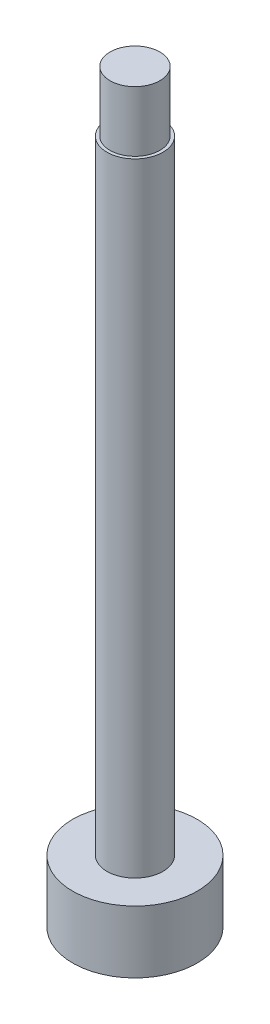
ISO-10303-21;
HEADER;
FILE_DESCRIPTION(('STEP AP214'),'2;1');
FILE_NAME('part.step','',(''),(''),'','','');
FILE_SCHEMA(('AUTOMOTIVE_DESIGN { 1 0 10303 214 1 1 1 1 }'));
ENDSEC;
DATA;
#1=APPLICATION_CONTEXT('core data for automotive mechanical design processes');
#2=APPLICATION_PROTOCOL_DEFINITION('international standard','automotive_design',2000,#1);
#3=PRODUCT_CONTEXT('',#1,'mechanical');
#4=PRODUCT('Part','Part','',(#3));
#5=PRODUCT_RELATED_PRODUCT_CATEGORY('part','',(#4));
#6=PRODUCT_DEFINITION_FORMATION('','',#4);
#7=PRODUCT_DEFINITION_CONTEXT('part definition',#1,'design');
#8=PRODUCT_DEFINITION('design','',#6,#7);
#9=PRODUCT_DEFINITION_SHAPE('','',#8);
#10=(LENGTH_UNIT() NAMED_UNIT(*) SI_UNIT(.MILLI.,.METRE.));
#11=(NAMED_UNIT(*) PLANE_ANGLE_UNIT() SI_UNIT($,.RADIAN.));
#12=(NAMED_UNIT(*) SI_UNIT($,.STERADIAN.) SOLID_ANGLE_UNIT());
#13=UNCERTAINTY_MEASURE_WITH_UNIT(LENGTH_MEASURE(1.E-05),#10,'distance_accuracy_value','');
#14=(GEOMETRIC_REPRESENTATION_CONTEXT(3) GLOBAL_UNCERTAINTY_ASSIGNED_CONTEXT((#13)) GLOBAL_UNIT_ASSIGNED_CONTEXT((#10,
#11,#12)) REPRESENTATION_CONTEXT('',''));
#15=CARTESIAN_POINT('',(0.,0.,0.));
#16=DIRECTION('',(0.,0.,1.));
#17=DIRECTION('',(1.,0.,0.));
#18=AXIS2_PLACEMENT_3D('',#15,#16,#17);
#19=CARTESIAN_POINT('',(1.1,0.,0.));
#20=DIRECTION('',(0.,-1.,0.));
#21=DIRECTION('',(1.,0.,0.));
#22=AXIS2_PLACEMENT_3D('',#19,#20,#21);
#23=PLANE('',#22);
#24=CARTESIAN_POINT('',(-0.9,0.,0.));
#25=DIRECTION('',(0.,1.,0.));
#26=DIRECTION('',(-1.,0.,0.));
#27=AXIS2_PLACEMENT_3D('',#24,#25,#26);
#28=CIRCLE('',#27,0.9);
#29=CARTESIAN_POINT('',(-1.8,0.,0.));
#30=VERTEX_POINT('',#29);
#31=EDGE_CURVE('E72',#30,#30,#28,.T.);
#32=ORIENTED_EDGE('',*,*,#31,.F.);
#33=EDGE_LOOP('',(#32));
#34=FACE_BOUND('',#33,.T.);
#35=CARTESIAN_POINT('',(-0.9,0.,0.));
#36=DIRECTION('',(0.,1.,0.));
#37=DIRECTION('',(-1.,0.,0.));
#38=AXIS2_PLACEMENT_3D('',#35,#36,#37);
#39=CIRCLE('',#38,2.);
#40=CARTESIAN_POINT('',(-2.9,0.,0.));
#41=VERTEX_POINT('',#40);
#42=EDGE_CURVE('E10',#41,#41,#39,.T.);
#43=ORIENTED_EDGE('',*,*,#42,.T.);
#44=EDGE_LOOP('',(#43));
#45=FACE_BOUND('',#44,.T.);
#46=ADVANCED_FACE('F45',(#34,#45),#23,.F.);
#47=CARTESIAN_POINT('',(-0.899999999999997,21.9383259911894,0.));
#48=DIRECTION('',(0.,1.,0.));
#49=DIRECTION('',(-1.,0.,0.));
#50=AXIS2_PLACEMENT_3D('',#47,#48,#49);
#51=CYLINDRICAL_SURFACE('',#50,2.);
#52=ORIENTED_EDGE('',*,*,#42,.F.);
#53=EDGE_LOOP('',(#52));
#54=FACE_BOUND('',#53,.T.);
#55=CARTESIAN_POINT('',(-0.9,-2.,0.));
#56=DIRECTION('',(0.,1.,0.));
#57=DIRECTION('',(-1.,0.,0.));
#58=AXIS2_PLACEMENT_3D('',#55,#56,#57);
#59=CIRCLE('',#58,2.);
#60=CARTESIAN_POINT('',(-2.9,-2.,0.));
#61=VERTEX_POINT('',#60);
#62=EDGE_CURVE('E52',#61,#61,#59,.T.);
#63=ORIENTED_EDGE('',*,*,#62,.T.);
#64=EDGE_LOOP('',(#63));
#65=FACE_BOUND('',#64,.T.);
#66=ADVANCED_FACE('F80',(#54,#65),#51,.T.);
#67=CARTESIAN_POINT('',(-0.9,-2.,0.));
#68=DIRECTION('',(0.,1.,0.));
#69=DIRECTION('',(-1.,0.,0.));
#70=AXIS2_PLACEMENT_3D('',#67,#68,#69);
#71=PLANE('',#70);
#72=ORIENTED_EDGE('',*,*,#62,.F.);
#73=EDGE_LOOP('',(#72));
#74=FACE_BOUND('',#73,.T.);
#75=ADVANCED_FACE('F84',(#74),#71,.F.);
#76=CARTESIAN_POINT('',(-0.0999999999999969,21.9383259911894,0.));
#77=DIRECTION('',(0.,-1.,0.));
#78=DIRECTION('',(1.,0.,0.));
#79=AXIS2_PLACEMENT_3D('',#76,#77,#78);
#80=PLANE('',#79);
#81=CARTESIAN_POINT('',(-0.899999999999997,21.9383259911894,0.));
#82=DIRECTION('',(0.,1.,0.));
#83=DIRECTION('',(-1.,0.,0.));
#84=AXIS2_PLACEMENT_3D('',#81,#82,#83);
#85=CIRCLE('',#84,0.8);
#86=CARTESIAN_POINT('',(-1.7,21.9383259911894,0.));
#87=VERTEX_POINT('',#86);
#88=EDGE_CURVE('E57',#87,#87,#85,.T.);
#89=ORIENTED_EDGE('',*,*,#88,.T.);
#90=EDGE_LOOP('',(#89));
#91=FACE_BOUND('',#90,.T.);
#92=ADVANCED_FACE('F89',(#91),#80,.F.);
#93=CARTESIAN_POINT('',(-0.899999999999997,21.9383259911894,0.));
#94=DIRECTION('',(0.,1.,0.));
#95=DIRECTION('',(-1.,0.,0.));
#96=AXIS2_PLACEMENT_3D('',#93,#94,#95);
#97=CYLINDRICAL_SURFACE('',#96,0.8);
#98=ORIENTED_EDGE('',*,*,#88,.F.);
#99=EDGE_LOOP('',(#98));
#100=FACE_BOUND('',#99,.T.);
#101=CARTESIAN_POINT('',(-0.899999999999997,20.,0.));
#102=DIRECTION('',(0.,1.,0.));
#103=DIRECTION('',(-1.,0.,0.));
#104=AXIS2_PLACEMENT_3D('',#101,#102,#103);
#105=CIRCLE('',#104,0.8);
#106=CARTESIAN_POINT('',(-1.7,20.,0.));
#107=VERTEX_POINT('',#106);
#108=EDGE_CURVE('E62',#107,#107,#105,.T.);
#109=ORIENTED_EDGE('',*,*,#108,.T.);
#110=EDGE_LOOP('',(#109));
#111=FACE_BOUND('',#110,.T.);
#112=ADVANCED_FACE('F95',(#100,#111),#97,.T.);
#113=CARTESIAN_POINT('',(0.,20.,0.));
#114=DIRECTION('',(0.,-1.,0.));
#115=DIRECTION('',(1.,0.,0.));
#116=AXIS2_PLACEMENT_3D('',#113,#114,#115);
#117=PLANE('',#116);
#118=ORIENTED_EDGE('',*,*,#108,.F.);
#119=EDGE_LOOP('',(#118));
#120=FACE_BOUND('',#119,.T.);
#121=CARTESIAN_POINT('',(-0.899999999999997,20.,0.));
#122=DIRECTION('',(0.,1.,0.));
#123=DIRECTION('',(-1.,0.,0.));
#124=AXIS2_PLACEMENT_3D('',#121,#122,#123);
#125=CIRCLE('',#124,0.899999999999997);
#126=CARTESIAN_POINT('',(-1.79999999999999,20.,0.));
#127=VERTEX_POINT('',#126);
#128=EDGE_CURVE('E68',#127,#127,#125,.T.);
#129=ORIENTED_EDGE('',*,*,#128,.T.);
#130=EDGE_LOOP('',(#129));
#131=FACE_BOUND('',#130,.T.);
#132=ADVANCED_FACE('F99',(#120,#131),#117,.F.);
#133=CARTESIAN_POINT('',(-0.899999999999997,21.9383259911894,0.));
#134=DIRECTION('',(0.,1.,0.));
#135=DIRECTION('',(-1.,0.,0.));
#136=AXIS2_PLACEMENT_3D('',#133,#134,#135);
#137=CYLINDRICAL_SURFACE('',#136,0.899999999999998);
#138=ORIENTED_EDGE('',*,*,#128,.F.);
#139=EDGE_LOOP('',(#138));
#140=FACE_BOUND('',#139,.T.);
#141=ORIENTED_EDGE('',*,*,#31,.T.);
#142=EDGE_LOOP('',(#141));
#143=FACE_BOUND('',#142,.T.);
#144=ADVANCED_FACE('F77',(#140,#143),#137,.T.);
#145=CLOSED_SHELL('',(#46,#66,#75,#92,#112,#132,#144));
#146=MANIFOLD_SOLID_BREP('B2',#145);
#147=ADVANCED_BREP_SHAPE_REPRESENTATION('',(#18,#146),#14);
#148=SHAPE_DEFINITION_REPRESENTATION(#9,#147);
ENDSEC;
END-ISO-10303-21;
